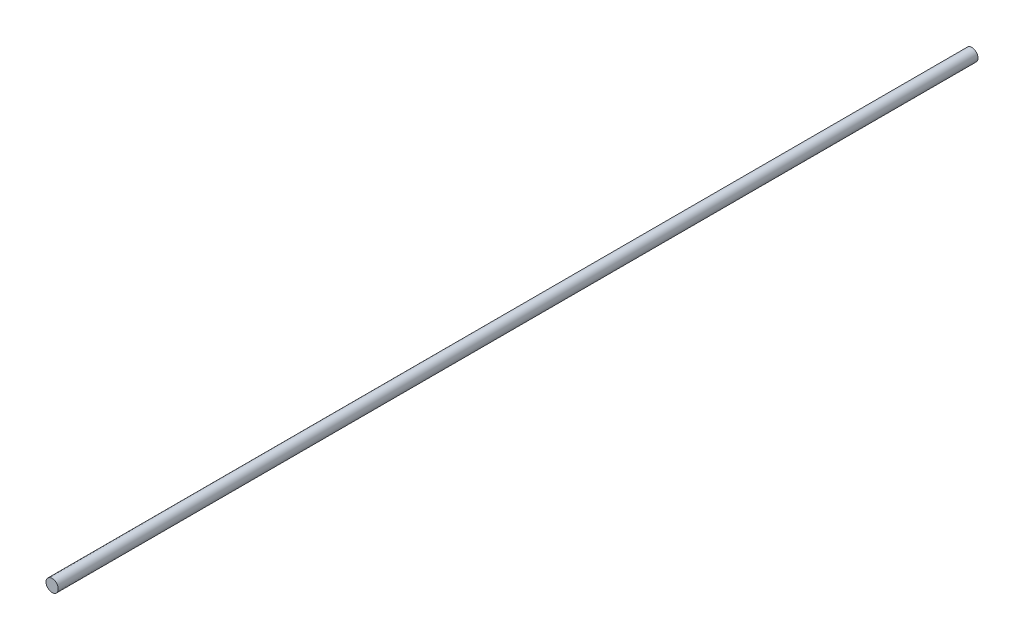
ISO-10303-21;
HEADER;
FILE_DESCRIPTION(('STEP AP214'),'2;1');
FILE_NAME('part.step','',(''),(''),'','','');
FILE_SCHEMA(('AUTOMOTIVE_DESIGN { 1 0 10303 214 1 1 1 1 }'));
ENDSEC;
DATA;
#1=APPLICATION_CONTEXT('core data for automotive mechanical design processes');
#2=APPLICATION_PROTOCOL_DEFINITION('international standard','automotive_design',2000,#1);
#3=PRODUCT_CONTEXT('',#1,'mechanical');
#4=PRODUCT('Part','Part','',(#3));
#5=PRODUCT_RELATED_PRODUCT_CATEGORY('part','',(#4));
#6=PRODUCT_DEFINITION_FORMATION('','',#4);
#7=PRODUCT_DEFINITION_CONTEXT('part definition',#1,'design');
#8=PRODUCT_DEFINITION('design','',#6,#7);
#9=PRODUCT_DEFINITION_SHAPE('','',#8);
#10=(LENGTH_UNIT() NAMED_UNIT(*) SI_UNIT(.MILLI.,.METRE.));
#11=(NAMED_UNIT(*) PLANE_ANGLE_UNIT() SI_UNIT($,.RADIAN.));
#12=(NAMED_UNIT(*) SI_UNIT($,.STERADIAN.) SOLID_ANGLE_UNIT());
#13=UNCERTAINTY_MEASURE_WITH_UNIT(LENGTH_MEASURE(1.E-05),#10,'distance_accuracy_value','');
#14=(GEOMETRIC_REPRESENTATION_CONTEXT(3) GLOBAL_UNCERTAINTY_ASSIGNED_CONTEXT((#13)) GLOBAL_UNIT_ASSIGNED_CONTEXT((#10,
#11,#12)) REPRESENTATION_CONTEXT('',''));
#15=CARTESIAN_POINT('',(0.,0.,0.));
#16=DIRECTION('',(0.,0.,1.));
#17=DIRECTION('',(1.,0.,0.));
#18=AXIS2_PLACEMENT_3D('',#15,#16,#17);
#19=CARTESIAN_POINT('',(0.,0.,600.));
#20=DIRECTION('',(0.,0.,-1.));
#21=DIRECTION('',(-1.,0.,0.));
#22=AXIS2_PLACEMENT_3D('',#19,#20,#21);
#23=CYLINDRICAL_SURFACE('',#22,4.);
#24=CARTESIAN_POINT('',(0.,0.,600.));
#25=DIRECTION('',(0.,0.,1.));
#26=DIRECTION('',(1.,0.,0.));
#27=AXIS2_PLACEMENT_3D('',#24,#25,#26);
#28=CIRCLE('',#27,4.);
#29=CARTESIAN_POINT('',(4.,0.,600.));
#30=VERTEX_POINT('',#29);
#31=EDGE_CURVE('E10',#30,#30,#28,.T.);
#32=ORIENTED_EDGE('',*,*,#31,.F.);
#33=EDGE_LOOP('',(#32));
#34=FACE_BOUND('',#33,.T.);
#35=CARTESIAN_POINT('',(0.,0.,0.));
#36=DIRECTION('',(0.,0.,1.));
#37=DIRECTION('',(1.,0.,0.));
#38=AXIS2_PLACEMENT_3D('',#35,#36,#37);
#39=CIRCLE('',#38,4.);
#40=CARTESIAN_POINT('',(4.,0.,0.));
#41=VERTEX_POINT('',#40);
#42=EDGE_CURVE('E34',#41,#41,#39,.T.);
#43=ORIENTED_EDGE('',*,*,#42,.T.);
#44=EDGE_LOOP('',(#43));
#45=FACE_BOUND('',#44,.T.);
#46=ADVANCED_FACE('F31',(#34,#45),#23,.T.);
#47=CARTESIAN_POINT('',(0.,0.,600.));
#48=DIRECTION('',(0.,0.,1.));
#49=DIRECTION('',(1.,0.,0.));
#50=AXIS2_PLACEMENT_3D('',#47,#48,#49);
#51=PLANE('',#50);
#52=ORIENTED_EDGE('',*,*,#31,.T.);
#53=EDGE_LOOP('',(#52));
#54=FACE_BOUND('',#53,.T.);
#55=ADVANCED_FACE('F46',(#54),#51,.T.);
#56=CARTESIAN_POINT('',(0.,0.,0.));
#57=DIRECTION('',(0.,0.,1.));
#58=DIRECTION('',(1.,0.,0.));
#59=AXIS2_PLACEMENT_3D('',#56,#57,#58);
#60=PLANE('',#59);
#61=ORIENTED_EDGE('',*,*,#42,.F.);
#62=EDGE_LOOP('',(#61));
#63=FACE_BOUND('',#62,.T.);
#64=ADVANCED_FACE('F44',(#63),#60,.F.);
#65=CLOSED_SHELL('',(#46,#55,#64));
#66=MANIFOLD_SOLID_BREP('B2',#65);
#67=ADVANCED_BREP_SHAPE_REPRESENTATION('',(#18,#66),#14);
#68=SHAPE_DEFINITION_REPRESENTATION(#9,#67);
ENDSEC;
END-ISO-10303-21;
